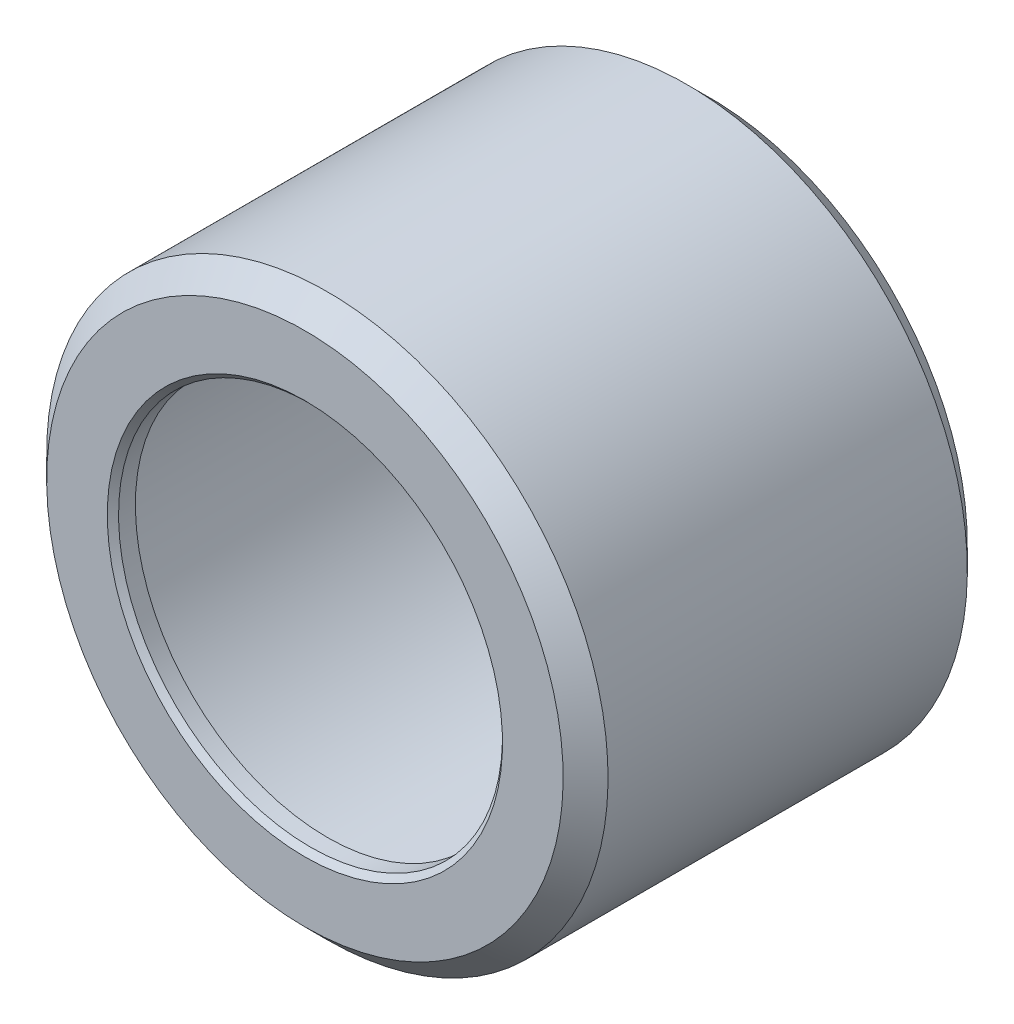
ISO-10303-21;
HEADER;
FILE_DESCRIPTION(('STEP AP214'),'2;1');
FILE_NAME('part.step','',(''),(''),'','','');
FILE_SCHEMA(('AUTOMOTIVE_DESIGN { 1 0 10303 214 1 1 1 1 }'));
ENDSEC;
DATA;
#1=APPLICATION_CONTEXT('core data for automotive mechanical design processes');
#2=APPLICATION_PROTOCOL_DEFINITION('international standard','automotive_design',2000,#1);
#3=PRODUCT_CONTEXT('',#1,'mechanical');
#4=PRODUCT('Part','Part','',(#3));
#5=PRODUCT_RELATED_PRODUCT_CATEGORY('part','',(#4));
#6=PRODUCT_DEFINITION_FORMATION('','',#4);
#7=PRODUCT_DEFINITION_CONTEXT('part definition',#1,'design');
#8=PRODUCT_DEFINITION('design','',#6,#7);
#9=PRODUCT_DEFINITION_SHAPE('','',#8);
#10=(LENGTH_UNIT() NAMED_UNIT(*) SI_UNIT(.MILLI.,.METRE.));
#11=(NAMED_UNIT(*) PLANE_ANGLE_UNIT() SI_UNIT($,.RADIAN.));
#12=(NAMED_UNIT(*) SI_UNIT($,.STERADIAN.) SOLID_ANGLE_UNIT());
#13=UNCERTAINTY_MEASURE_WITH_UNIT(LENGTH_MEASURE(1.E-05),#10,'distance_accuracy_value','');
#14=(GEOMETRIC_REPRESENTATION_CONTEXT(3) GLOBAL_UNCERTAINTY_ASSIGNED_CONTEXT((#13)) GLOBAL_UNIT_ASSIGNED_CONTEXT((#10,
#11,#12)) REPRESENTATION_CONTEXT('',''));
#15=CARTESIAN_POINT('',(0.,0.,0.));
#16=DIRECTION('',(0.,0.,1.));
#17=DIRECTION('',(1.,0.,0.));
#18=AXIS2_PLACEMENT_3D('',#15,#16,#17);
#19=CARTESIAN_POINT('',(0.,0.,-9.00000000000001));
#20=DIRECTION('',(0.,0.,-1.));
#21=DIRECTION('',(0.,1.,0.));
#22=AXIS2_PLACEMENT_3D('',#19,#20,#21);
#23=CYLINDRICAL_SURFACE('',#22,8.55);
#24=CARTESIAN_POINT('',(0.,0.,-8.75000000000001));
#25=DIRECTION('',(0.,0.,-1.));
#26=DIRECTION('',(0.,1.,0.));
#27=AXIS2_PLACEMENT_3D('',#24,#25,#26);
#28=CIRCLE('',#27,8.55);
#29=CARTESIAN_POINT('',(0.,8.55,-8.75000000000001));
#30=VERTEX_POINT('',#29);
#31=EDGE_CURVE('E46',#30,#30,#28,.T.);
#32=ORIENTED_EDGE('',*,*,#31,.T.);
#33=EDGE_LOOP('',(#32));
#34=FACE_BOUND('',#33,.T.);
#35=CARTESIAN_POINT('',(0.,0.,-8.00000000000001));
#36=DIRECTION('',(0.,0.,1.));
#37=DIRECTION('',(0.,-1.,0.));
#38=AXIS2_PLACEMENT_3D('',#35,#36,#37);
#39=CIRCLE('',#38,8.55);
#40=CARTESIAN_POINT('',(0.,-8.55,-8.00000000000001));
#41=VERTEX_POINT('',#40);
#42=EDGE_CURVE('E56',#41,#41,#39,.T.);
#43=ORIENTED_EDGE('',*,*,#42,.T.);
#44=EDGE_LOOP('',(#43));
#45=FACE_BOUND('',#44,.T.);
#46=ADVANCED_FACE('F35',(#34,#45),#23,.F.);
#47=CARTESIAN_POINT('',(0.,0.,8.99999999999999));
#48=DIRECTION('',(0.,0.,1.));
#49=DIRECTION('',(0.,-1.,0.));
#50=AXIS2_PLACEMENT_3D('',#47,#48,#49);
#51=CYLINDRICAL_SURFACE('',#50,8.55);
#52=CARTESIAN_POINT('',(0.,0.,8.75));
#53=DIRECTION('',(0.,0.,1.));
#54=DIRECTION('',(0.,-1.,0.));
#55=AXIS2_PLACEMENT_3D('',#52,#53,#54);
#56=CIRCLE('',#55,8.55);
#57=CARTESIAN_POINT('',(0.,-8.55,8.74999999999999));
#58=VERTEX_POINT('',#57);
#59=EDGE_CURVE('E42',#58,#58,#56,.T.);
#60=ORIENTED_EDGE('',*,*,#59,.T.);
#61=EDGE_LOOP('',(#60));
#62=FACE_BOUND('',#61,.T.);
#63=CARTESIAN_POINT('',(0.,0.,7.99999999999999));
#64=DIRECTION('',(0.,0.,1.));
#65=DIRECTION('',(0.,-1.,0.));
#66=AXIS2_PLACEMENT_3D('',#63,#64,#65);
#67=CIRCLE('',#66,8.55);
#68=CARTESIAN_POINT('',(0.,-8.55,7.99999999999999));
#69=VERTEX_POINT('',#68);
#70=EDGE_CURVE('E61',#69,#69,#67,.T.);
#71=ORIENTED_EDGE('',*,*,#70,.F.);
#72=EDGE_LOOP('',(#71));
#73=FACE_BOUND('',#72,.T.);
#74=ADVANCED_FACE('F104',(#62,#73),#51,.F.);
#75=CARTESIAN_POINT('',(0.,8.55,9.));
#76=DIRECTION('',(0.,0.,1.));
#77=DIRECTION('',(0.,-1.,0.));
#78=AXIS2_PLACEMENT_3D('',#75,#76,#77);
#79=PLANE('',#78);
#80=CARTESIAN_POINT('',(0.,0.,8.99999999999999));
#81=DIRECTION('',(0.,0.,1.));
#82=DIRECTION('',(0.,-1.,0.));
#83=AXIS2_PLACEMENT_3D('',#80,#81,#82);
#84=CIRCLE('',#83,8.8);
#85=CARTESIAN_POINT('',(0.,-8.80000000000001,8.99999999999999));
#86=VERTEX_POINT('',#85);
#87=EDGE_CURVE('E10',#86,#86,#84,.F.);
#88=ORIENTED_EDGE('',*,*,#87,.T.);
#89=EDGE_LOOP('',(#88));
#90=FACE_BOUND('',#89,.T.);
#91=CARTESIAN_POINT('',(0.,0.,9.));
#92=DIRECTION('',(0.,0.,1.));
#93=DIRECTION('',(0.,-1.,0.));
#94=AXIS2_PLACEMENT_3D('',#91,#92,#93);
#95=CIRCLE('',#94,11.5);
#96=CARTESIAN_POINT('',(0.,-11.5,9.));
#97=VERTEX_POINT('',#96);
#98=EDGE_CURVE('E55',#97,#97,#95,.T.);
#99=ORIENTED_EDGE('',*,*,#98,.T.);
#100=EDGE_LOOP('',(#99));
#101=FACE_BOUND('',#100,.T.);
#102=ADVANCED_FACE('F110',(#90,#101),#79,.T.);
#103=CARTESIAN_POINT('',(0.,0.,9.));
#104=DIRECTION('',(0.,0.,-1.));
#105=DIRECTION('',(0.,1.,0.));
#106=AXIS2_PLACEMENT_3D('',#103,#104,#105);
#107=CONICAL_SURFACE('',#106,11.5,0.785398163397449);
#108=CARTESIAN_POINT('',(0.,0.,8.));
#109=DIRECTION('',(0.,0.,1.));
#110=DIRECTION('',(0.,-1.,0.));
#111=AXIS2_PLACEMENT_3D('',#108,#109,#110);
#112=CIRCLE('',#111,12.5);
#113=CARTESIAN_POINT('',(0.,-12.5,8.));
#114=VERTEX_POINT('',#113);
#115=EDGE_CURVE('E77',#114,#114,#112,.T.);
#116=ORIENTED_EDGE('',*,*,#115,.T.);
#117=EDGE_LOOP('',(#116));
#118=FACE_BOUND('',#117,.T.);
#119=ORIENTED_EDGE('',*,*,#98,.F.);
#120=EDGE_LOOP('',(#119));
#121=FACE_BOUND('',#120,.T.);
#122=ADVANCED_FACE('F145',(#118,#121),#107,.T.);
#123=CARTESIAN_POINT('',(0.,0.,0.));
#124=DIRECTION('',(0.,0.,1.));
#125=DIRECTION('',(0.,-1.,0.));
#126=AXIS2_PLACEMENT_3D('',#123,#124,#125);
#127=CYLINDRICAL_SURFACE('',#126,12.5);
#128=CARTESIAN_POINT('',(0.,0.,-8.));
#129=DIRECTION('',(0.,0.,1.));
#130=DIRECTION('',(0.,-1.,0.));
#131=AXIS2_PLACEMENT_3D('',#128,#129,#130);
#132=CIRCLE('',#131,12.5);
#133=CARTESIAN_POINT('',(0.,-12.5,-8.));
#134=VERTEX_POINT('',#133);
#135=EDGE_CURVE('E80',#134,#134,#132,.T.);
#136=ORIENTED_EDGE('',*,*,#135,.T.);
#137=EDGE_LOOP('',(#136));
#138=FACE_BOUND('',#137,.T.);
#139=ORIENTED_EDGE('',*,*,#115,.F.);
#140=EDGE_LOOP('',(#139));
#141=FACE_BOUND('',#140,.T.);
#142=ADVANCED_FACE('F101',(#138,#141),#127,.T.);
#143=CARTESIAN_POINT('',(0.,0.,-8.));
#144=DIRECTION('',(0.,0.,1.));
#145=DIRECTION('',(0.,-1.,0.));
#146=AXIS2_PLACEMENT_3D('',#143,#144,#145);
#147=CONICAL_SURFACE('',#146,12.5,0.785398163397447);
#148=CARTESIAN_POINT('',(0.,0.,-9.));
#149=DIRECTION('',(0.,0.,1.));
#150=DIRECTION('',(0.,-1.,0.));
#151=AXIS2_PLACEMENT_3D('',#148,#149,#150);
#152=CIRCLE('',#151,11.5);
#153=CARTESIAN_POINT('',(0.,-11.5,-9.00000000000001));
#154=VERTEX_POINT('',#153);
#155=EDGE_CURVE('E64',#154,#154,#152,.T.);
#156=ORIENTED_EDGE('',*,*,#155,.T.);
#157=EDGE_LOOP('',(#156));
#158=FACE_BOUND('',#157,.T.);
#159=ORIENTED_EDGE('',*,*,#135,.F.);
#160=EDGE_LOOP('',(#159));
#161=FACE_BOUND('',#160,.T.);
#162=ADVANCED_FACE('F86',(#158,#161),#147,.T.);
#163=CARTESIAN_POINT('',(0.,11.5,-9.));
#164=DIRECTION('',(0.,0.,-1.));
#165=DIRECTION('',(0.,1.,0.));
#166=AXIS2_PLACEMENT_3D('',#163,#164,#165);
#167=PLANE('',#166);
#168=CARTESIAN_POINT('',(0.,0.,-9.00000000000001));
#169=DIRECTION('',(0.,0.,-1.));
#170=DIRECTION('',(0.,1.,0.));
#171=AXIS2_PLACEMENT_3D('',#168,#169,#170);
#172=CIRCLE('',#171,8.8);
#173=CARTESIAN_POINT('',(0.,8.8,-9.));
#174=VERTEX_POINT('',#173);
#175=EDGE_CURVE('E50',#174,#174,#172,.F.);
#176=ORIENTED_EDGE('',*,*,#175,.T.);
#177=EDGE_LOOP('',(#176));
#178=FACE_BOUND('',#177,.T.);
#179=ORIENTED_EDGE('',*,*,#155,.F.);
#180=EDGE_LOOP('',(#179));
#181=FACE_BOUND('',#180,.T.);
#182=ADVANCED_FACE('F89',(#178,#181),#167,.T.);
#183=CARTESIAN_POINT('',(0.,8.55,8.));
#184=DIRECTION('',(0.,0.,1.));
#185=DIRECTION('',(0.,-1.,0.));
#186=AXIS2_PLACEMENT_3D('',#183,#184,#185);
#187=PLANE('',#186);
#188=CARTESIAN_POINT('',(0.,0.,7.99999999999999));
#189=DIRECTION('',(0.,0.,1.));
#190=DIRECTION('',(0.,-1.,0.));
#191=AXIS2_PLACEMENT_3D('',#188,#189,#190);
#192=CIRCLE('',#191,11.0857864376269);
#193=CARTESIAN_POINT('',(0.,-11.0857864376269,7.99999999999999));
#194=VERTEX_POINT('',#193);
#195=EDGE_CURVE('E65',#194,#194,#192,.T.);
#196=ORIENTED_EDGE('',*,*,#195,.F.);
#197=EDGE_LOOP('',(#196));
#198=FACE_BOUND('',#197,.T.);
#199=ORIENTED_EDGE('',*,*,#70,.T.);
#200=EDGE_LOOP('',(#199));
#201=FACE_BOUND('',#200,.T.);
#202=ADVANCED_FACE('F91',(#198,#201),#187,.F.);
#203=CARTESIAN_POINT('',(0.,0.,8.29289321881345));
#204=DIRECTION('',(0.,0.,-1.));
#205=DIRECTION('',(0.,1.,0.));
#206=AXIS2_PLACEMENT_3D('',#203,#204,#205);
#207=CONICAL_SURFACE('',#206,10.7928932188135,0.785398163397449);
#208=CARTESIAN_POINT('',(0.,0.,7.58578643762691));
#209=DIRECTION('',(0.,0.,-1.));
#210=DIRECTION('',(0.,1.,0.));
#211=AXIS2_PLACEMENT_3D('',#208,#209,#210);
#212=CIRCLE('',#211,11.5);
#213=CARTESIAN_POINT('',(0.,11.5,7.58578643762691));
#214=VERTEX_POINT('',#213);
#215=EDGE_CURVE('E70',#214,#214,#212,.F.);
#216=ORIENTED_EDGE('',*,*,#215,.F.);
#217=EDGE_LOOP('',(#216));
#218=FACE_BOUND('',#217,.T.);
#219=ORIENTED_EDGE('',*,*,#195,.T.);
#220=EDGE_LOOP('',(#219));
#221=FACE_BOUND('',#220,.T.);
#222=ADVANCED_FACE('F98',(#218,#221),#207,.F.);
#223=CARTESIAN_POINT('',(0.,0.,0.));
#224=DIRECTION('',(0.,0.,1.));
#225=DIRECTION('',(0.,-1.,0.));
#226=AXIS2_PLACEMENT_3D('',#223,#224,#225);
#227=CYLINDRICAL_SURFACE('',#226,11.5);
#228=CARTESIAN_POINT('',(0.,0.,-7.5857864376269));
#229=DIRECTION('',(0.,0.,1.));
#230=DIRECTION('',(0.,-1.,0.));
#231=AXIS2_PLACEMENT_3D('',#228,#229,#230);
#232=CIRCLE('',#231,11.5);
#233=CARTESIAN_POINT('',(0.,-11.5,-7.58578643762691));
#234=VERTEX_POINT('',#233);
#235=EDGE_CURVE('E59',#234,#234,#232,.T.);
#236=ORIENTED_EDGE('',*,*,#235,.F.);
#237=EDGE_LOOP('',(#236));
#238=FACE_BOUND('',#237,.T.);
#239=ORIENTED_EDGE('',*,*,#215,.T.);
#240=EDGE_LOOP('',(#239));
#241=FACE_BOUND('',#240,.T.);
#242=ADVANCED_FACE('F131',(#238,#241),#227,.F.);
#243=CARTESIAN_POINT('',(0.,0.,-7.29289321881345));
#244=DIRECTION('',(0.,0.,1.));
#245=DIRECTION('',(0.,-1.,0.));
#246=AXIS2_PLACEMENT_3D('',#243,#244,#245);
#247=CONICAL_SURFACE('',#246,11.7928932188135,0.785398163397447);
#248=CARTESIAN_POINT('',(0.,0.,-8.00000000000001));
#249=DIRECTION('',(0.,0.,-1.));
#250=DIRECTION('',(0.,1.,0.));
#251=AXIS2_PLACEMENT_3D('',#248,#249,#250);
#252=CIRCLE('',#251,11.0857864376269);
#253=CARTESIAN_POINT('',(0.,11.0857864376269,-8.));
#254=VERTEX_POINT('',#253);
#255=EDGE_CURVE('E60',#254,#254,#252,.F.);
#256=ORIENTED_EDGE('',*,*,#255,.F.);
#257=EDGE_LOOP('',(#256));
#258=FACE_BOUND('',#257,.T.);
#259=ORIENTED_EDGE('',*,*,#235,.T.);
#260=EDGE_LOOP('',(#259));
#261=FACE_BOUND('',#260,.T.);
#262=ADVANCED_FACE('F123',(#258,#261),#247,.F.);
#263=CARTESIAN_POINT('',(0.,11.5,-8.));
#264=DIRECTION('',(0.,0.,-1.));
#265=DIRECTION('',(0.,1.,0.));
#266=AXIS2_PLACEMENT_3D('',#263,#264,#265);
#267=PLANE('',#266);
#268=ORIENTED_EDGE('',*,*,#42,.F.);
#269=EDGE_LOOP('',(#268));
#270=FACE_BOUND('',#269,.T.);
#271=ORIENTED_EDGE('',*,*,#255,.T.);
#272=EDGE_LOOP('',(#271));
#273=FACE_BOUND('',#272,.T.);
#274=ADVANCED_FACE('F116',(#270,#273),#267,.F.);
#275=CARTESIAN_POINT('',(0.,0.,-9.00000000000001));
#276=DIRECTION('',(0.,0.,-1.));
#277=DIRECTION('',(0.,1.,0.));
#278=AXIS2_PLACEMENT_3D('',#275,#276,#277);
#279=CONICAL_SURFACE('',#278,8.8,0.785398163397452);
#280=ORIENTED_EDGE('',*,*,#31,.F.);
#281=EDGE_LOOP('',(#280));
#282=FACE_BOUND('',#281,.T.);
#283=ORIENTED_EDGE('',*,*,#175,.F.);
#284=EDGE_LOOP('',(#283));
#285=FACE_BOUND('',#284,.T.);
#286=ADVANCED_FACE('F114',(#282,#285),#279,.F.);
#287=CARTESIAN_POINT('',(0.,0.,8.75));
#288=DIRECTION('',(0.,0.,1.));
#289=DIRECTION('',(0.,-1.,0.));
#290=AXIS2_PLACEMENT_3D('',#287,#288,#289);
#291=CONICAL_SURFACE('',#290,8.55,0.785398163397455);
#292=ORIENTED_EDGE('',*,*,#87,.F.);
#293=EDGE_LOOP('',(#292));
#294=FACE_BOUND('',#293,.T.);
#295=ORIENTED_EDGE('',*,*,#59,.F.);
#296=EDGE_LOOP('',(#295));
#297=FACE_BOUND('',#296,.T.);
#298=ADVANCED_FACE('F37',(#294,#297),#291,.F.);
#299=CLOSED_SHELL('',(#46,#74,#102,#122,#142,#162,#182,#202,#222,#242,#262,#274,#286,#298));
#300=MANIFOLD_SOLID_BREP('B2',#299);
#301=ADVANCED_BREP_SHAPE_REPRESENTATION('',(#18,#300),#14);
#302=SHAPE_DEFINITION_REPRESENTATION(#9,#301);
ENDSEC;
END-ISO-10303-21;
